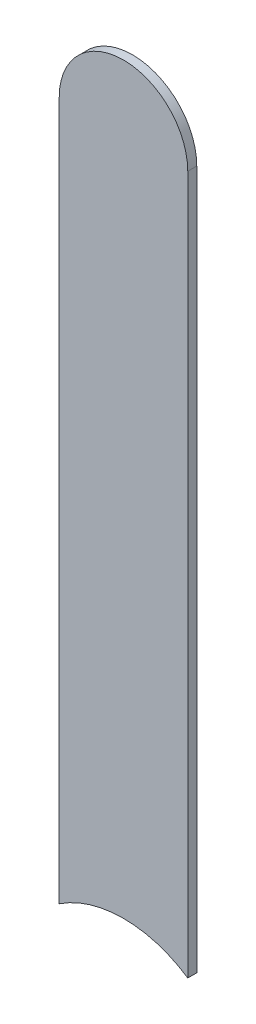
ISO-10303-21;
HEADER;
FILE_DESCRIPTION(('STEP AP214'),'2;1');
FILE_NAME('part.step','',(''),(''),'','','');
FILE_SCHEMA(('AUTOMOTIVE_DESIGN { 1 0 10303 214 1 1 1 1 }'));
ENDSEC;
DATA;
#1=APPLICATION_CONTEXT('core data for automotive mechanical design processes');
#2=APPLICATION_PROTOCOL_DEFINITION('international standard','automotive_design',2000,#1);
#3=PRODUCT_CONTEXT('',#1,'mechanical');
#4=PRODUCT('Part','Part','',(#3));
#5=PRODUCT_RELATED_PRODUCT_CATEGORY('part','',(#4));
#6=PRODUCT_DEFINITION_FORMATION('','',#4);
#7=PRODUCT_DEFINITION_CONTEXT('part definition',#1,'design');
#8=PRODUCT_DEFINITION('design','',#6,#7);
#9=PRODUCT_DEFINITION_SHAPE('','',#8);
#10=(LENGTH_UNIT() NAMED_UNIT(*) SI_UNIT(.MILLI.,.METRE.));
#11=(NAMED_UNIT(*) PLANE_ANGLE_UNIT() SI_UNIT($,.RADIAN.));
#12=(NAMED_UNIT(*) SI_UNIT($,.STERADIAN.) SOLID_ANGLE_UNIT());
#13=UNCERTAINTY_MEASURE_WITH_UNIT(LENGTH_MEASURE(1.E-05),#10,'distance_accuracy_value','');
#14=(GEOMETRIC_REPRESENTATION_CONTEXT(3) GLOBAL_UNCERTAINTY_ASSIGNED_CONTEXT((#13)) GLOBAL_UNIT_ASSIGNED_CONTEXT((#10,
#11,#12)) REPRESENTATION_CONTEXT('',''));
#15=CARTESIAN_POINT('',(0.,0.,0.));
#16=DIRECTION('',(0.,0.,1.));
#17=DIRECTION('',(1.,0.,0.));
#18=AXIS2_PLACEMENT_3D('',#15,#16,#17);
#19=CARTESIAN_POINT('',(177.01,-116.364,-0.035));
#20=DIRECTION('',(1.,0.,0.));
#21=DIRECTION('',(0.,1.,0.));
#22=AXIS2_PLACEMENT_3D('',#19,#20,#21);
#23=PLANE('',#22);
#24=DIRECTION('',(0.,0.,-1.));
#25=VECTOR('',#24,1.);
#26=CARTESIAN_POINT('',(177.01,-119.0818342613,-0.045));
#27=LINE('',#26,#25);
#28=CARTESIAN_POINT('',(177.01,-119.0818342613,0.));
#29=VERTEX_POINT('',#28);
#30=CARTESIAN_POINT('',(177.01,-119.0818342613,-0.035));
#31=VERTEX_POINT('',#30);
#32=EDGE_CURVE('E11',#29,#31,#27,.T.);
#33=ORIENTED_EDGE('',*,*,#32,.F.);
#34=DIRECTION('',(0.,-1.,0.));
#35=VECTOR('',#34,1.);
#36=CARTESIAN_POINT('',(177.01,-116.364,0.));
#37=LINE('',#36,#35);
#38=CARTESIAN_POINT('',(177.01,-116.364,0.));
#39=VERTEX_POINT('',#38);
#40=EDGE_CURVE('E21',#39,#29,#37,.T.);
#41=ORIENTED_EDGE('',*,*,#40,.F.);
#42=DIRECTION('',(0.,0.,1.));
#43=VECTOR('',#42,1.);
#44=CARTESIAN_POINT('',(177.01,-116.364,-0.035));
#45=LINE('',#44,#43);
#46=CARTESIAN_POINT('',(177.01,-116.364,-0.035));
#47=VERTEX_POINT('',#46);
#48=EDGE_CURVE('E104',#47,#39,#45,.T.);
#49=ORIENTED_EDGE('',*,*,#48,.F.);
#50=DIRECTION('',(0.,-1.,0.));
#51=VECTOR('',#50,1.);
#52=CARTESIAN_POINT('',(177.01,-116.364,-0.035));
#53=LINE('',#52,#51);
#54=EDGE_CURVE('E76',#47,#31,#53,.T.);
#55=ORIENTED_EDGE('',*,*,#54,.T.);
#56=EDGE_LOOP('',(#33,#41,#49,#55));
#57=FACE_BOUND('',#56,.T.);
#58=ADVANCED_FACE('F17',(#57),#23,.F.);
#59=CARTESIAN_POINT('',(177.26,-119.456,-0.045));
#60=DIRECTION('',(0.,0.,-1.));
#61=DIRECTION('',(0.,-1.,0.));
#62=AXIS2_PLACEMENT_3D('',#59,#60,#61);
#63=CYLINDRICAL_SURFACE('',#62,0.45);
#64=DIRECTION('',(0.,0.,-1.));
#65=VECTOR('',#64,1.);
#66=CARTESIAN_POINT('',(177.51,-119.0818342613,-0.045));
#67=LINE('',#66,#65);
#68=CARTESIAN_POINT('',(177.51,-119.0818342613,0.));
#69=VERTEX_POINT('',#68);
#70=CARTESIAN_POINT('',(177.51,-119.0818342613,-0.035));
#71=VERTEX_POINT('',#70);
#72=EDGE_CURVE('E89',#69,#71,#67,.T.);
#73=ORIENTED_EDGE('',*,*,#72,.F.);
#74=CARTESIAN_POINT('',(177.26,-119.456,0.));
#75=DIRECTION('',(0.,0.,-1.));
#76=DIRECTION('',(0.,-1.,0.));
#77=AXIS2_PLACEMENT_3D('',#74,#75,#76);
#78=CIRCLE('',#77,0.45);
#79=EDGE_CURVE('E113',#29,#69,#78,.T.);
#80=ORIENTED_EDGE('',*,*,#79,.F.);
#81=ORIENTED_EDGE('',*,*,#32,.T.);
#82=CARTESIAN_POINT('',(177.26,-119.456,-0.035));
#83=DIRECTION('',(0.,0.,-1.));
#84=DIRECTION('',(0.,-1.,0.));
#85=AXIS2_PLACEMENT_3D('',#82,#83,#84);
#86=CIRCLE('',#85,0.45);
#87=EDGE_CURVE('E81',#31,#71,#86,.T.);
#88=ORIENTED_EDGE('',*,*,#87,.T.);
#89=EDGE_LOOP('',(#73,#80,#81,#88));
#90=FACE_BOUND('',#89,.T.);
#91=ADVANCED_FACE('F121',(#90),#63,.F.);
#92=CARTESIAN_POINT('',(177.51,-119.456,0.));
#93=DIRECTION('',(0.,0.,1.));
#94=DIRECTION('',(1.,0.,0.));
#95=AXIS2_PLACEMENT_3D('',#92,#93,#94);
#96=PLANE('',#95);
#97=ORIENTED_EDGE('',*,*,#79,.T.);
#98=DIRECTION('',(0.,1.,0.));
#99=VECTOR('',#98,1.);
#100=CARTESIAN_POINT('',(177.51,-119.456,0.));
#101=LINE('',#100,#99);
#102=CARTESIAN_POINT('',(177.51,-116.364,0.));
#103=VERTEX_POINT('',#102);
#104=EDGE_CURVE('E96',#69,#103,#101,.T.);
#105=ORIENTED_EDGE('',*,*,#104,.T.);
#106=CARTESIAN_POINT('',(177.26,-116.364,0.));
#107=DIRECTION('',(0.,0.,1.));
#108=DIRECTION('',(1.,0.,0.));
#109=AXIS2_PLACEMENT_3D('',#106,#107,#108);
#110=CIRCLE('',#109,0.25);
#111=EDGE_CURVE('E93',#103,#39,#110,.T.);
#112=ORIENTED_EDGE('',*,*,#111,.T.);
#113=ORIENTED_EDGE('',*,*,#40,.T.);
#114=EDGE_LOOP('',(#97,#105,#112,#113));
#115=FACE_BOUND('',#114,.T.);
#116=ADVANCED_FACE('F19',(#115),#96,.T.);
#117=CARTESIAN_POINT('',(177.26,-116.364,-0.035));
#118=DIRECTION('',(0.,0.,-1.));
#119=DIRECTION('',(1.,0.,0.));
#120=AXIS2_PLACEMENT_3D('',#117,#118,#119);
#121=CYLINDRICAL_SURFACE('',#120,0.25);
#122=CARTESIAN_POINT('',(177.26,-116.364,-0.035));
#123=DIRECTION('',(0.,0.,1.));
#124=DIRECTION('',(1.,0.,0.));
#125=AXIS2_PLACEMENT_3D('',#122,#123,#124);
#126=CIRCLE('',#125,0.25);
#127=CARTESIAN_POINT('',(177.51,-116.364,-0.035));
#128=VERTEX_POINT('',#127);
#129=EDGE_CURVE('E70',#128,#47,#126,.T.);
#130=ORIENTED_EDGE('',*,*,#129,.T.);
#131=ORIENTED_EDGE('',*,*,#48,.T.);
#132=ORIENTED_EDGE('',*,*,#111,.F.);
#133=DIRECTION('',(0.,0.,1.));
#134=VECTOR('',#133,1.);
#135=CARTESIAN_POINT('',(177.51,-116.364,-0.035));
#136=LINE('',#135,#134);
#137=EDGE_CURVE('E87',#128,#103,#136,.T.);
#138=ORIENTED_EDGE('',*,*,#137,.F.);
#139=EDGE_LOOP('',(#130,#131,#132,#138));
#140=FACE_BOUND('',#139,.T.);
#141=ADVANCED_FACE('F92',(#140),#121,.T.);
#142=CARTESIAN_POINT('',(177.51,-119.456,-0.035));
#143=DIRECTION('',(0.,0.,1.));
#144=DIRECTION('',(1.,0.,0.));
#145=AXIS2_PLACEMENT_3D('',#142,#143,#144);
#146=PLANE('',#145);
#147=ORIENTED_EDGE('',*,*,#54,.F.);
#148=ORIENTED_EDGE('',*,*,#129,.F.);
#149=DIRECTION('',(0.,1.,0.));
#150=VECTOR('',#149,1.);
#151=CARTESIAN_POINT('',(177.51,-119.456,-0.035));
#152=LINE('',#151,#150);
#153=EDGE_CURVE('E74',#71,#128,#152,.T.);
#154=ORIENTED_EDGE('',*,*,#153,.F.);
#155=ORIENTED_EDGE('',*,*,#87,.F.);
#156=EDGE_LOOP('',(#147,#148,#154,#155));
#157=FACE_BOUND('',#156,.T.);
#158=ADVANCED_FACE('F72',(#157),#146,.F.);
#159=CARTESIAN_POINT('',(177.51,-119.456,-0.035));
#160=DIRECTION('',(-1.,0.,0.));
#161=DIRECTION('',(0.,0.,1.));
#162=AXIS2_PLACEMENT_3D('',#159,#160,#161);
#163=PLANE('',#162);
#164=ORIENTED_EDGE('',*,*,#137,.T.);
#165=ORIENTED_EDGE('',*,*,#104,.F.);
#166=ORIENTED_EDGE('',*,*,#72,.T.);
#167=ORIENTED_EDGE('',*,*,#153,.T.);
#168=EDGE_LOOP('',(#164,#165,#166,#167));
#169=FACE_BOUND('',#168,.T.);
#170=ADVANCED_FACE('F85',(#169),#163,.F.);
#171=CLOSED_SHELL('',(#58,#91,#116,#141,#158,#170));
#172=MANIFOLD_SOLID_BREP('B1',#171);
#173=ADVANCED_BREP_SHAPE_REPRESENTATION('',(#18,#172),#14);
#174=SHAPE_DEFINITION_REPRESENTATION(#9,#173);
ENDSEC;
END-ISO-10303-21;
